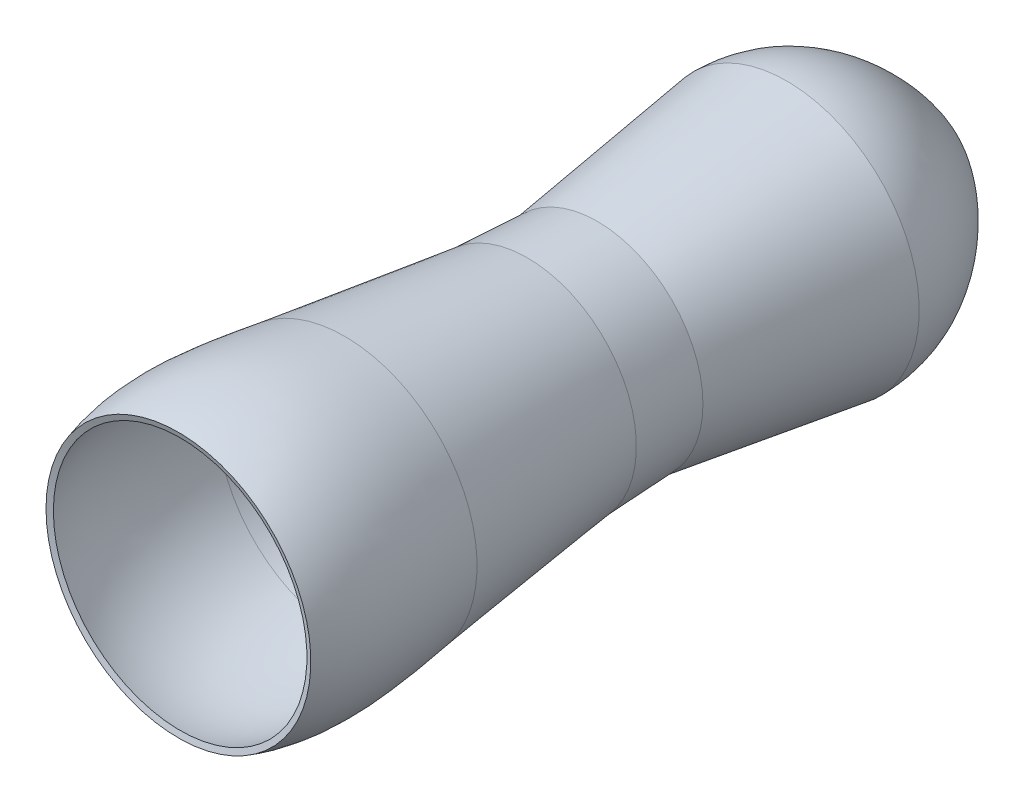
ISO-10303-21;
HEADER;
FILE_DESCRIPTION(('STEP AP214'),'2;1');
FILE_NAME('part.step','',(''),(''),'','','');
FILE_SCHEMA(('AUTOMOTIVE_DESIGN { 1 0 10303 214 1 1 1 1 }'));
ENDSEC;
DATA;
#1=APPLICATION_CONTEXT('core data for automotive mechanical design processes');
#2=APPLICATION_PROTOCOL_DEFINITION('international standard','automotive_design',2000,#1);
#3=PRODUCT_CONTEXT('',#1,'mechanical');
#4=PRODUCT('Part','Part','',(#3));
#5=PRODUCT_RELATED_PRODUCT_CATEGORY('part','',(#4));
#6=PRODUCT_DEFINITION_FORMATION('','',#4);
#7=PRODUCT_DEFINITION_CONTEXT('part definition',#1,'design');
#8=PRODUCT_DEFINITION('design','',#6,#7);
#9=PRODUCT_DEFINITION_SHAPE('','',#8);
#10=(LENGTH_UNIT() NAMED_UNIT(*) SI_UNIT(.MILLI.,.METRE.));
#11=(NAMED_UNIT(*) PLANE_ANGLE_UNIT() SI_UNIT($,.RADIAN.));
#12=(NAMED_UNIT(*) SI_UNIT($,.STERADIAN.) SOLID_ANGLE_UNIT());
#13=UNCERTAINTY_MEASURE_WITH_UNIT(LENGTH_MEASURE(1.E-05),#10,'distance_accuracy_value','');
#14=(GEOMETRIC_REPRESENTATION_CONTEXT(3) GLOBAL_UNCERTAINTY_ASSIGNED_CONTEXT((#13)) GLOBAL_UNIT_ASSIGNED_CONTEXT((#10,
#11,#12)) REPRESENTATION_CONTEXT('',''));
#15=CARTESIAN_POINT('',(0.,0.,0.));
#16=DIRECTION('',(0.,0.,1.));
#17=DIRECTION('',(1.,0.,0.));
#18=AXIS2_PLACEMENT_3D('',#15,#16,#17);
#19=CARTESIAN_POINT('',(0.,685.868541251402,-3435.66768728404));
#20=CARTESIAN_POINT('',(0.,685.636717489307,-3459.80495828058));
#21=CARTESIAN_POINT('',(0.,683.609490166346,-3483.06630548663));
#22=CARTESIAN_POINT('',(0.,676.352608641617,-3527.93964570982));
#23=CARTESIAN_POINT('',(0.,671.122702007708,-3549.55232212724));
#24=CARTESIAN_POINT('',(0.,657.820638691016,-3591.22201577684));
#25=CARTESIAN_POINT('',(0.,649.747920296181,-3611.27930080194));
#26=CARTESIAN_POINT('',(0.,631.105102715371,-3649.90610461057));
#27=CARTESIAN_POINT('',(0.,620.534545336862,-3668.4754464413));
#28=CARTESIAN_POINT('',(0.,597.242400649338,-3704.16741253382));
#29=CARTESIAN_POINT('',(0.,584.52063872925,-3721.28969182561));
#30=CARTESIAN_POINT('',(0.,557.283805645886,-3754.11070333309));
#31=CARTESIAN_POINT('',(0.,542.768768536274,-3769.80915023377));
#32=CARTESIAN_POINT('',(0.,497.089868351931,-3814.79238088169));
#33=CARTESIAN_POINT('',(0.,463.789092189158,-3841.9633873573));
#34=CARTESIAN_POINT('',(0.,429.178513801302,-3866.380248312));
#35=B_SPLINE_CURVE_WITH_KNOTS('',3,(#19,#20,#21,#22,#23,#24,#25,#26,#27,#28,#29,#30,#31,#32,#33,
#34),.UNSPECIFIED.,.F.,.F.,(4,2,2,2,2,2,2,4),(0.,0.125,0.25,0.375,0.5,0.625,0.75,1.),.UNSPECIFIED.);
#36=CARTESIAN_POINT('',(0.,256.489289103036,-3590.99820808181));
#37=DIRECTION('',(0.,0.,-1.));
#38=AXIS1_PLACEMENT('',#36,#37);
#39=SURFACE_OF_REVOLUTION('',#35,#38);
#40=CARTESIAN_POINT('',(0.,256.489289103036,-3866.380248312));
#41=DIRECTION('',(0.,0.,-1.));
#42=DIRECTION('',(-1.,0.,0.));
#43=AXIS2_PLACEMENT_3D('',#40,#41,#42);
#44=CIRCLE('',#43,172.689224698266);
#45=CARTESIAN_POINT('',(-172.689224698266,256.489289103036,-3866.380248312));
#46=VERTEX_POINT('',#45);
#47=EDGE_CURVE('E10',#46,#46,#44,.T.);
#48=ORIENTED_EDGE('',*,*,#47,.T.);
#49=EDGE_LOOP('',(#48));
#50=FACE_BOUND('',#49,.T.);
#51=CARTESIAN_POINT('',(0.,256.489289103036,-3435.66768728404));
#52=DIRECTION('',(0.,0.,-1.));
#53=DIRECTION('',(-1.,0.,0.));
#54=AXIS2_PLACEMENT_3D('',#51,#52,#53);
#55=CIRCLE('',#54,429.379252148366);
#56=CARTESIAN_POINT('',(-429.379252148366,256.489289103036,-3435.66768728404));
#57=VERTEX_POINT('',#56);
#58=EDGE_CURVE('E78',#57,#57,#55,.T.);
#59=ORIENTED_EDGE('',*,*,#58,.F.);
#60=EDGE_LOOP('',(#59));
#61=FACE_BOUND('',#60,.T.);
#62=ADVANCED_FACE('F37',(#50,#61),#39,.F.);
#63=CARTESIAN_POINT('',(0.,256.489289103036,-3882.72274956549));
#64=DIRECTION('',(0.,0.,-1.));
#65=DIRECTION('',(-1.,0.,0.));
#66=AXIS2_PLACEMENT_3D('',#63,#64,#65);
#67=CONICAL_SURFACE('',#66,184.218433377954,0.614390306946688);
#68=ORIENTED_EDGE('',*,*,#47,.F.);
#69=EDGE_LOOP('',(#68));
#70=FACE_BOUND('',#69,.T.);
#71=CARTESIAN_POINT('',(0.,256.489289103036,-3882.72274956549));
#72=DIRECTION('',(0.,0.,-1.));
#73=DIRECTION('',(-1.,0.,0.));
#74=AXIS2_PLACEMENT_3D('',#71,#72,#73);
#75=CIRCLE('',#74,184.218433377954);
#76=CARTESIAN_POINT('',(-184.218433377954,256.489289103036,-3882.72274956549));
#77=VERTEX_POINT('',#76);
#78=EDGE_CURVE('E44',#77,#77,#75,.T.);
#79=ORIENTED_EDGE('',*,*,#78,.T.);
#80=EDGE_LOOP('',(#79));
#81=FACE_BOUND('',#80,.T.);
#82=ADVANCED_FACE('F122',(#70,#81),#67,.F.);
#83=CARTESIAN_POINT('',(0.,705.879930513522,-3434.33933652629));
#84=CARTESIAN_POINT('',(0.,704.549359555002,-3636.19825874155));
#85=CARTESIAN_POINT('',(0.,582.594975495987,-3782.62499074484));
#86=CARTESIAN_POINT('',(0.,440.70772248099,-3882.72274956549));
#87=B_SPLINE_CURVE_WITH_KNOTS('',3,(#83,#84,#85,#86),.UNSPECIFIED.,.F.,.F.,(4,4),(0.,1.),.UNSPECIFIED.);
#88=CARTESIAN_POINT('',(0.,256.489289103036,-3590.99820808181));
#89=DIRECTION('',(0.,0.,-1.));
#90=AXIS1_PLACEMENT('',#88,#89);
#91=SURFACE_OF_REVOLUTION('',#87,#90);
#92=ORIENTED_EDGE('',*,*,#78,.F.);
#93=EDGE_LOOP('',(#92));
#94=FACE_BOUND('',#93,.T.);
#95=CARTESIAN_POINT('',(0.,256.489289103036,-3434.33933652629));
#96=DIRECTION('',(0.,0.,-1.));
#97=DIRECTION('',(-1.,0.,0.));
#98=AXIS2_PLACEMENT_3D('',#95,#96,#97);
#99=CIRCLE('',#98,449.390641410486);
#100=CARTESIAN_POINT('',(-449.390641410486,256.489289103036,-3434.33933652629));
#101=VERTEX_POINT('',#100);
#102=EDGE_CURVE('E48',#101,#101,#99,.T.);
#103=ORIENTED_EDGE('',*,*,#102,.T.);
#104=EDGE_LOOP('',(#103));
#105=FACE_BOUND('',#104,.T.);
#106=ADVANCED_FACE('F119',(#94,#105),#91,.T.);
#107=CARTESIAN_POINT('',(0.,256.489289103036,-2791.35798843859));
#108=DIRECTION('',(0.,0.,-1.));
#109=DIRECTION('',(-1.,0.,0.));
#110=AXIS2_PLACEMENT_3D('',#107,#108,#109);
#111=CONICAL_SURFACE('',#110,358.356143633481,0.140647058798244);
#112=ORIENTED_EDGE('',*,*,#102,.F.);
#113=EDGE_LOOP('',(#112));
#114=FACE_BOUND('',#113,.T.);
#115=CARTESIAN_POINT('',(0.,256.489289103036,-2791.35798843859));
#116=DIRECTION('',(0.,0.,-1.));
#117=DIRECTION('',(-1.,0.,0.));
#118=AXIS2_PLACEMENT_3D('',#115,#116,#117);
#119=CIRCLE('',#118,358.356143633481);
#120=CARTESIAN_POINT('',(-358.356143633481,256.489289103036,-2791.35798843859));
#121=VERTEX_POINT('',#120);
#122=EDGE_CURVE('E52',#121,#121,#119,.T.);
#123=ORIENTED_EDGE('',*,*,#122,.T.);
#124=EDGE_LOOP('',(#123));
#125=FACE_BOUND('',#124,.T.);
#126=ADVANCED_FACE('F115',(#114,#125),#111,.T.);
#127=CARTESIAN_POINT('',(0.,256.489289103036,-2553.99682033937));
#128=DIRECTION('',(0.,0.,1.));
#129=DIRECTION('',(1.,0.,0.));
#130=AXIS2_PLACEMENT_3D('',#127,#128,#129);
#131=CONICAL_SURFACE('',#130,369.864563904958,0.0484469095694796);
#132=ORIENTED_EDGE('',*,*,#122,.F.);
#133=EDGE_LOOP('',(#132));
#134=FACE_BOUND('',#133,.T.);
#135=CARTESIAN_POINT('',(0.,256.489289103036,-2553.99682033937));
#136=DIRECTION('',(0.,0.,-1.));
#137=DIRECTION('',(-1.,0.,0.));
#138=AXIS2_PLACEMENT_3D('',#135,#136,#137);
#139=CIRCLE('',#138,369.864563904958);
#140=CARTESIAN_POINT('',(-369.864563904958,256.489289103036,-2553.99682033937));
#141=VERTEX_POINT('',#140);
#142=EDGE_CURVE('E57',#141,#141,#139,.T.);
#143=ORIENTED_EDGE('',*,*,#142,.T.);
#144=EDGE_LOOP('',(#143));
#145=FACE_BOUND('',#144,.T.);
#146=ADVANCED_FACE('F111',(#134,#145),#131,.T.);
#147=CARTESIAN_POINT('',(0.,256.489289103036,-1933.68331617424));
#148=DIRECTION('',(0.,0.,1.));
#149=DIRECTION('',(1.,0.,0.));
#150=AXIS2_PLACEMENT_3D('',#147,#148,#149);
#151=CONICAL_SURFACE('',#150,449.390641410486,0.1275075045998);
#152=ORIENTED_EDGE('',*,*,#142,.F.);
#153=EDGE_LOOP('',(#152));
#154=FACE_BOUND('',#153,.T.);
#155=CARTESIAN_POINT('',(0.,256.489289103036,-1933.68331617424));
#156=DIRECTION('',(0.,0.,-1.));
#157=DIRECTION('',(-1.,0.,0.));
#158=AXIS2_PLACEMENT_3D('',#155,#156,#157);
#159=CIRCLE('',#158,449.390641410486);
#160=CARTESIAN_POINT('',(-449.390641410486,256.489289103036,-1933.68331617424));
#161=VERTEX_POINT('',#160);
#162=EDGE_CURVE('E60',#161,#161,#159,.T.);
#163=ORIENTED_EDGE('',*,*,#162,.T.);
#164=EDGE_LOOP('',(#163));
#165=FACE_BOUND('',#164,.T.);
#166=ADVANCED_FACE('F107',(#154,#165),#151,.T.);
#167=CARTESIAN_POINT('',(0.,705.879930513522,-1369.50106692385));
#168=CARTESIAN_POINT('',(0.,763.003765888583,-1553.33625242354));
#169=CARTESIAN_POINT('',(0.,732.43076159204,-1748.72246297743));
#170=CARTESIAN_POINT('',(0.,705.879930513522,-1933.68331617424));
#171=B_SPLINE_CURVE_WITH_KNOTS('',3,(#167,#168,#169,#170),.UNSPECIFIED.,.F.,.F.,(4,4),(0.,1.),.UNSPECIFIED.);
#172=CARTESIAN_POINT('',(0.,256.489289103036,-3590.99820808181));
#173=DIRECTION('',(0.,0.,-1.));
#174=AXIS1_PLACEMENT('',#172,#173);
#175=SURFACE_OF_REVOLUTION('',#171,#174);
#176=ORIENTED_EDGE('',*,*,#162,.F.);
#177=EDGE_LOOP('',(#176));
#178=FACE_BOUND('',#177,.T.);
#179=CARTESIAN_POINT('',(0.,256.489289103036,-1369.50106692385));
#180=DIRECTION('',(0.,0.,-1.));
#181=DIRECTION('',(-1.,0.,0.));
#182=AXIS2_PLACEMENT_3D('',#179,#180,#181);
#183=CIRCLE('',#182,449.390641410486);
#184=CARTESIAN_POINT('',(-449.390641410486,256.489289103036,-1369.50106692385));
#185=VERTEX_POINT('',#184);
#186=EDGE_CURVE('E63',#185,#185,#183,.T.);
#187=ORIENTED_EDGE('',*,*,#186,.T.);
#188=EDGE_LOOP('',(#187));
#189=FACE_BOUND('',#188,.T.);
#190=ADVANCED_FACE('F103',(#178,#189),#175,.T.);
#191=CARTESIAN_POINT('',(0.,256.489289103036,-1375.43583004644));
#192=DIRECTION('',(0.,0.,1.));
#193=DIRECTION('',(1.,0.,0.));
#194=AXIS2_PLACEMENT_3D('',#191,#192,#193);
#195=CONICAL_SURFACE('',#194,430.291463766441,1.26952118440464);
#196=ORIENTED_EDGE('',*,*,#186,.F.);
#197=EDGE_LOOP('',(#196));
#198=FACE_BOUND('',#197,.T.);
#199=CARTESIAN_POINT('',(0.,256.489289103036,-1375.43583004644));
#200=DIRECTION('',(0.,0.,-1.));
#201=DIRECTION('',(-1.,0.,0.));
#202=AXIS2_PLACEMENT_3D('',#199,#200,#201);
#203=CIRCLE('',#202,430.291463766441);
#204=CARTESIAN_POINT('',(-430.291463766441,256.489289103036,-1375.43583004644));
#205=VERTEX_POINT('',#204);
#206=EDGE_CURVE('E66',#205,#205,#203,.T.);
#207=ORIENTED_EDGE('',*,*,#206,.T.);
#208=EDGE_LOOP('',(#207));
#209=FACE_BOUND('',#208,.T.);
#210=ADVANCED_FACE('F98',(#198,#209),#195,.F.);
#211=CARTESIAN_POINT('',(0.,686.780752869477,-1375.43583004644));
#212=CARTESIAN_POINT('',(0.,693.699132771893,-1397.70047044335));
#213=CARTESIAN_POINT('',(0.,699.29856053678,-1420.16823924114));
#214=CARTESIAN_POINT('',(0.,708.198993280112,-1465.45822375557));
#215=CARTESIAN_POINT('',(0.,711.499711828944,-1488.2804194916));
#216=CARTESIAN_POINT('',(0.,716.135668203322,-1534.21211093016));
#217=CARTESIAN_POINT('',(0.,717.470729454561,-1557.32145138771));
#218=CARTESIAN_POINT('',(0.,718.509619910909,-1603.74761900743));
#219=CARTESIAN_POINT('',(0.,718.213387067755,-1627.06427548873));
#220=CARTESIAN_POINT('',(0.,715.386452432161,-1697.19470897592));
#221=CARTESIAN_POINT('',(0.,710.915101314062,-1744.18830056102));
#222=CARTESIAN_POINT('',(0.,702.409981040443,-1814.50151673169));
#223=CARTESIAN_POINT('',(0.,699.275875537278,-1837.90975057005));
#224=CARTESIAN_POINT('',(0.,694.391171085543,-1872.91276351174));
#225=CARTESIAN_POINT('',(0.,692.732374432214,-1884.56223517952));
#226=CARTESIAN_POINT('',(0.,690.231723793288,-1902.00125240225));
#227=CARTESIAN_POINT('',(0.,688.978287169009,-1910.71196622652));
#228=CARTESIAN_POINT('',(0.,687.517830994188,-1920.85737919706));
#229=CARTESIAN_POINT('',(0.,686.893112787703,-1925.20157230369));
#230=CARTESIAN_POINT('',(0.,686.476986311605,-1928.09682757975));
#231=CARTESIAN_POINT('',(0.,686.268935891305,-1929.54522686906));
#232=CARTESIAN_POINT('',(0.,686.061451770271,-1930.99062192798));
#233=B_SPLINE_CURVE_WITH_KNOTS('',3,(#211,#212,#213,#214,#215,#216,#217,#218,#219,#220,#221,
#222,#223,#224,#225,#226,#227,#228,#229,#230,#231,#232),.UNSPECIFIED.,.F.,.F.,(4,2,2,2,2,2,2,2,
1,1,2,4),(0.,0.125,0.25,0.375,0.500000000000001,0.750000000000001,0.875000000000001,0.9375,
0.96875,0.984375,0.9921875,1.),.UNSPECIFIED.);
#234=CARTESIAN_POINT('',(0.,256.489289103036,-3590.99820808181));
#235=DIRECTION('',(0.,0.,-1.));
#236=AXIS1_PLACEMENT('',#234,#235);
#237=SURFACE_OF_REVOLUTION('',#233,#236);
#238=CARTESIAN_POINT('',(0.,256.489289103036,-1930.99062192798));
#239=DIRECTION('',(0.,0.,-1.));
#240=DIRECTION('',(-1.,0.,0.));
#241=AXIS2_PLACEMENT_3D('',#238,#239,#240);
#242=CIRCLE('',#241,429.572162667235);
#243=CARTESIAN_POINT('',(-429.572162667235,256.489289103036,-1930.99062192798));
#244=VERTEX_POINT('',#243);
#245=EDGE_CURVE('E69',#244,#244,#242,.T.);
#246=ORIENTED_EDGE('',*,*,#245,.T.);
#247=EDGE_LOOP('',(#246));
#248=FACE_BOUND('',#247,.T.);
#249=ORIENTED_EDGE('',*,*,#206,.F.);
#250=EDGE_LOOP('',(#249));
#251=FACE_BOUND('',#250,.T.);
#252=ADVANCED_FACE('F93',(#248,#251),#237,.F.);
#253=CARTESIAN_POINT('',(0.,256.489289103036,-1930.99062192798));
#254=DIRECTION('',(0.,0.,1.));
#255=DIRECTION('',(1.,0.,0.));
#256=AXIS2_PLACEMENT_3D('',#253,#254,#255);
#257=CONICAL_SURFACE('',#256,429.572162667235,0.1275075045998);
#258=CARTESIAN_POINT('',(0.,256.489289103036,-2552.23817123545));
#259=DIRECTION('',(0.,0.,-1.));
#260=DIRECTION('',(-1.,0.,0.));
#261=AXIS2_PLACEMENT_3D('',#258,#259,#260);
#262=CIRCLE('',#261,349.926337734182);
#263=CARTESIAN_POINT('',(-349.926337734182,256.489289103036,-2552.23817123545));
#264=VERTEX_POINT('',#263);
#265=EDGE_CURVE('E72',#264,#264,#262,.T.);
#266=ORIENTED_EDGE('',*,*,#265,.T.);
#267=EDGE_LOOP('',(#266));
#268=FACE_BOUND('',#267,.T.);
#269=ORIENTED_EDGE('',*,*,#245,.F.);
#270=EDGE_LOOP('',(#269));
#271=FACE_BOUND('',#270,.T.);
#272=ADVANCED_FACE('F97',(#268,#271),#257,.F.);
#273=CARTESIAN_POINT('',(0.,256.489289103036,-2552.23817123545));
#274=DIRECTION('',(0.,0.,1.));
#275=DIRECTION('',(1.,0.,0.));
#276=AXIS2_PLACEMENT_3D('',#273,#274,#275);
#277=CONICAL_SURFACE('',#276,349.926337734182,0.04844690956948);
#278=CARTESIAN_POINT('',(0.,256.489289103036,-2792.28379827676));
#279=DIRECTION('',(0.,0.,-1.));
#280=DIRECTION('',(-1.,0.,0.));
#281=AXIS2_PLACEMENT_3D('',#278,#279,#280);
#282=CIRCLE('',#281,338.287761877633);
#283=CARTESIAN_POINT('',(-338.287761877633,256.489289103036,-2792.28379827676));
#284=VERTEX_POINT('',#283);
#285=EDGE_CURVE('E75',#284,#284,#282,.T.);
#286=ORIENTED_EDGE('',*,*,#285,.T.);
#287=EDGE_LOOP('',(#286));
#288=FACE_BOUND('',#287,.T.);
#289=ORIENTED_EDGE('',*,*,#265,.F.);
#290=EDGE_LOOP('',(#289));
#291=FACE_BOUND('',#290,.T.);
#292=ADVANCED_FACE('F149',(#288,#291),#277,.F.);
#293=CARTESIAN_POINT('',(0.,256.489289103036,-2792.28379827676));
#294=DIRECTION('',(0.,0.,-1.));
#295=DIRECTION('',(-1.,0.,0.));
#296=AXIS2_PLACEMENT_3D('',#293,#294,#295);
#297=CONICAL_SURFACE('',#296,338.287761877633,0.140647058798244);
#298=ORIENTED_EDGE('',*,*,#58,.T.);
#299=EDGE_LOOP('',(#298));
#300=FACE_BOUND('',#299,.T.);
#301=ORIENTED_EDGE('',*,*,#285,.F.);
#302=EDGE_LOOP('',(#301));
#303=FACE_BOUND('',#302,.T.);
#304=ADVANCED_FACE('F146',(#300,#303),#297,.F.);
#305=CLOSED_SHELL('',(#62,#82,#106,#126,#146,#166,#190,#210,#252,#272,#292,#304));
#306=MANIFOLD_SOLID_BREP('B2',#305);
#307=ADVANCED_BREP_SHAPE_REPRESENTATION('',(#18,#306),#14);
#308=SHAPE_DEFINITION_REPRESENTATION(#9,#307);
ENDSEC;
END-ISO-10303-21;
